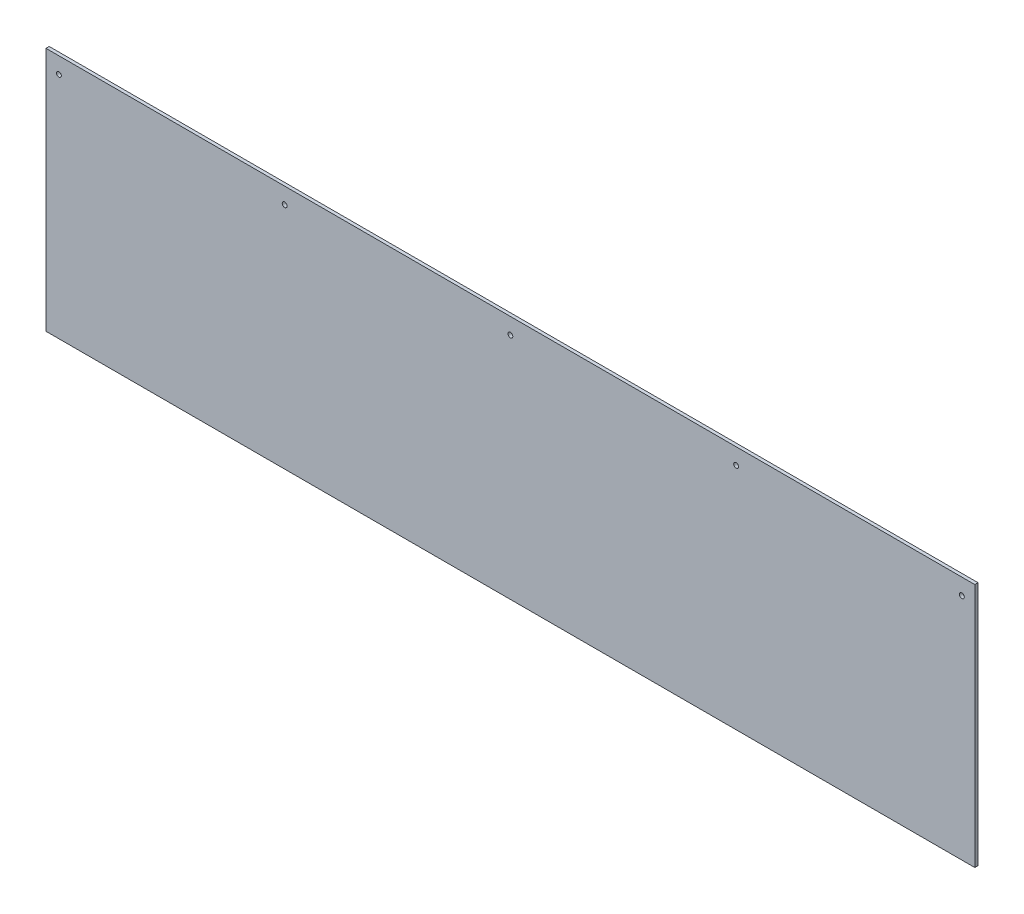
ISO-10303-21;
HEADER;
FILE_DESCRIPTION(('STEP AP214'),'2;1');
FILE_NAME('part.step','',(''),(''),'','','');
FILE_SCHEMA(('AUTOMOTIVE_DESIGN { 1 0 10303 214 1 1 1 1 }'));
ENDSEC;
DATA;
#1=APPLICATION_CONTEXT('core data for automotive mechanical design processes');
#2=APPLICATION_PROTOCOL_DEFINITION('international standard','automotive_design',2000,#1);
#3=PRODUCT_CONTEXT('',#1,'mechanical');
#4=PRODUCT('Part','Part','',(#3));
#5=PRODUCT_RELATED_PRODUCT_CATEGORY('part','',(#4));
#6=PRODUCT_DEFINITION_FORMATION('','',#4);
#7=PRODUCT_DEFINITION_CONTEXT('part definition',#1,'design');
#8=PRODUCT_DEFINITION('design','',#6,#7);
#9=PRODUCT_DEFINITION_SHAPE('','',#8);
#10=(LENGTH_UNIT() NAMED_UNIT(*) SI_UNIT(.MILLI.,.METRE.));
#11=(NAMED_UNIT(*) PLANE_ANGLE_UNIT() SI_UNIT($,.RADIAN.));
#12=(NAMED_UNIT(*) SI_UNIT($,.STERADIAN.) SOLID_ANGLE_UNIT());
#13=UNCERTAINTY_MEASURE_WITH_UNIT(LENGTH_MEASURE(1.E-05),#10,'distance_accuracy_value','');
#14=(GEOMETRIC_REPRESENTATION_CONTEXT(3) GLOBAL_UNCERTAINTY_ASSIGNED_CONTEXT((#13)) GLOBAL_UNIT_ASSIGNED_CONTEXT((#10,
#11,#12)) REPRESENTATION_CONTEXT('',''));
#15=CARTESIAN_POINT('',(0.,0.,0.));
#16=DIRECTION('',(0.,0.,1.));
#17=DIRECTION('',(1.,0.,0.));
#18=AXIS2_PLACEMENT_3D('',#15,#16,#17);
#19=CARTESIAN_POINT('',(0.,0.,6.35));
#20=DIRECTION('',(1.,0.,0.));
#21=DIRECTION('',(0.,0.,-1.));
#22=AXIS2_PLACEMENT_3D('',#19,#20,#21);
#23=PLANE('',#22);
#24=DIRECTION('',(0.,-1.,0.));
#25=VECTOR('',#24,1.);
#26=CARTESIAN_POINT('',(0.,0.,0.));
#27=LINE('',#26,#25);
#28=CARTESIAN_POINT('',(0.,482.6,0.));
#29=VERTEX_POINT('',#28);
#30=CARTESIAN_POINT('',(0.,0.,0.));
#31=VERTEX_POINT('',#30);
#32=EDGE_CURVE('E95',#29,#31,#27,.T.);
#33=ORIENTED_EDGE('',*,*,#32,.T.);
#34=DIRECTION('',(0.,0.,-1.));
#35=VECTOR('',#34,1.);
#36=CARTESIAN_POINT('',(0.,0.,6.35));
#37=LINE('',#36,#35);
#38=CARTESIAN_POINT('',(0.,0.,6.35));
#39=VERTEX_POINT('',#38);
#40=EDGE_CURVE('E11',#39,#31,#37,.T.);
#41=ORIENTED_EDGE('',*,*,#40,.F.);
#42=DIRECTION('',(0.,-1.,0.));
#43=VECTOR('',#42,1.);
#44=CARTESIAN_POINT('',(0.,0.,6.35));
#45=LINE('',#44,#43);
#46=CARTESIAN_POINT('',(0.,482.6,6.35));
#47=VERTEX_POINT('',#46);
#48=EDGE_CURVE('E83',#47,#39,#45,.T.);
#49=ORIENTED_EDGE('',*,*,#48,.F.);
#50=DIRECTION('',(0.,0.,-1.));
#51=VECTOR('',#50,1.);
#52=CARTESIAN_POINT('',(0.,482.6,6.35));
#53=LINE('',#52,#51);
#54=EDGE_CURVE('E91',#47,#29,#53,.T.);
#55=ORIENTED_EDGE('',*,*,#54,.T.);
#56=EDGE_LOOP('',(#33,#41,#49,#55));
#57=FACE_BOUND('',#56,.T.);
#58=ADVANCED_FACE('F32',(#57),#23,.F.);
#59=CARTESIAN_POINT('',(0.,0.,6.35));
#60=DIRECTION('',(0.,1.,0.));
#61=DIRECTION('',(0.,0.,1.));
#62=AXIS2_PLACEMENT_3D('',#59,#60,#61);
#63=PLANE('',#62);
#64=DIRECTION('',(1.,0.,0.));
#65=VECTOR('',#64,1.);
#66=CARTESIAN_POINT('',(0.,0.,0.));
#67=LINE('',#66,#65);
#68=CARTESIAN_POINT('',(1828.8,0.,0.));
#69=VERTEX_POINT('',#68);
#70=EDGE_CURVE('E87',#31,#69,#67,.T.);
#71=ORIENTED_EDGE('',*,*,#70,.T.);
#72=DIRECTION('',(0.,0.,-1.));
#73=VECTOR('',#72,1.);
#74=CARTESIAN_POINT('',(1828.8,0.,6.35));
#75=LINE('',#74,#73);
#76=CARTESIAN_POINT('',(1828.8,0.,6.35));
#77=VERTEX_POINT('',#76);
#78=EDGE_CURVE('E40',#77,#69,#75,.T.);
#79=ORIENTED_EDGE('',*,*,#78,.F.);
#80=DIRECTION('',(1.,0.,0.));
#81=VECTOR('',#80,1.);
#82=CARTESIAN_POINT('',(0.,0.,6.35));
#83=LINE('',#82,#81);
#84=EDGE_CURVE('E78',#39,#77,#83,.T.);
#85=ORIENTED_EDGE('',*,*,#84,.F.);
#86=ORIENTED_EDGE('',*,*,#40,.T.);
#87=EDGE_LOOP('',(#71,#79,#85,#86));
#88=FACE_BOUND('',#87,.T.);
#89=ADVANCED_FACE('F86',(#88),#63,.F.);
#90=CARTESIAN_POINT('',(1828.8,0.,6.35));
#91=DIRECTION('',(-1.,0.,0.));
#92=DIRECTION('',(0.,0.,1.));
#93=AXIS2_PLACEMENT_3D('',#90,#91,#92);
#94=PLANE('',#93);
#95=DIRECTION('',(0.,1.,0.));
#96=VECTOR('',#95,1.);
#97=CARTESIAN_POINT('',(1828.8,0.,0.));
#98=LINE('',#97,#96);
#99=CARTESIAN_POINT('',(1828.8,482.6,0.));
#100=VERTEX_POINT('',#99);
#101=EDGE_CURVE('E65',#69,#100,#98,.T.);
#102=ORIENTED_EDGE('',*,*,#101,.T.);
#103=DIRECTION('',(0.,0.,-1.));
#104=VECTOR('',#103,1.);
#105=CARTESIAN_POINT('',(1828.8,482.6,6.35));
#106=LINE('',#105,#104);
#107=CARTESIAN_POINT('',(1828.8,482.6,6.35));
#108=VERTEX_POINT('',#107);
#109=EDGE_CURVE('E88',#108,#100,#106,.T.);
#110=ORIENTED_EDGE('',*,*,#109,.F.);
#111=DIRECTION('',(0.,1.,0.));
#112=VECTOR('',#111,1.);
#113=CARTESIAN_POINT('',(1828.8,0.,6.35));
#114=LINE('',#113,#112);
#115=EDGE_CURVE('E81',#77,#108,#114,.T.);
#116=ORIENTED_EDGE('',*,*,#115,.F.);
#117=ORIENTED_EDGE('',*,*,#78,.T.);
#118=EDGE_LOOP('',(#102,#110,#116,#117));
#119=FACE_BOUND('',#118,.T.);
#120=ADVANCED_FACE('F89',(#119),#94,.F.);
#121=CARTESIAN_POINT('',(0.,482.6,6.35));
#122=DIRECTION('',(0.,-1.,0.));
#123=DIRECTION('',(1.,0.,0.));
#124=AXIS2_PLACEMENT_3D('',#121,#122,#123);
#125=PLANE('',#124);
#126=DIRECTION('',(-1.,0.,0.));
#127=VECTOR('',#126,1.);
#128=CARTESIAN_POINT('',(0.,482.6,0.));
#129=LINE('',#128,#127);
#130=EDGE_CURVE('E71',#100,#29,#129,.T.);
#131=ORIENTED_EDGE('',*,*,#130,.T.);
#132=ORIENTED_EDGE('',*,*,#54,.F.);
#133=DIRECTION('',(-1.,0.,0.));
#134=VECTOR('',#133,1.);
#135=CARTESIAN_POINT('',(0.,482.6,6.35));
#136=LINE('',#135,#134);
#137=EDGE_CURVE('E48',#108,#47,#136,.T.);
#138=ORIENTED_EDGE('',*,*,#137,.F.);
#139=ORIENTED_EDGE('',*,*,#109,.T.);
#140=EDGE_LOOP('',(#131,#132,#138,#139));
#141=FACE_BOUND('',#140,.T.);
#142=ADVANCED_FACE('F103',(#141),#125,.F.);
#143=CARTESIAN_POINT('',(0.,0.,6.35));
#144=DIRECTION('',(0.,0.,-1.));
#145=DIRECTION('',(-1.,0.,0.));
#146=AXIS2_PLACEMENT_3D('',#143,#144,#145);
#147=PLANE('',#146);
#148=CARTESIAN_POINT('',(25.4,450.85,6.35));
#149=DIRECTION('',(0.,0.,1.));
#150=DIRECTION('',(1.,0.,0.));
#151=AXIS2_PLACEMENT_3D('',#148,#149,#150);
#152=CIRCLE('',#151,4.7625);
#153=CARTESIAN_POINT('',(30.1625,450.85,6.35));
#154=VERTEX_POINT('',#153);
#155=EDGE_CURVE('E133',#154,#154,#152,.T.);
#156=ORIENTED_EDGE('',*,*,#155,.F.);
#157=EDGE_LOOP('',(#156));
#158=FACE_BOUND('',#157,.T.);
#159=CARTESIAN_POINT('',(469.9,450.85,6.35));
#160=DIRECTION('',(0.,0.,1.));
#161=DIRECTION('',(1.,0.,0.));
#162=AXIS2_PLACEMENT_3D('',#159,#160,#161);
#163=CIRCLE('',#162,4.76250000000001);
#164=CARTESIAN_POINT('',(474.6625,450.85,6.35));
#165=VERTEX_POINT('',#164);
#166=EDGE_CURVE('E127',#165,#165,#163,.T.);
#167=ORIENTED_EDGE('',*,*,#166,.F.);
#168=EDGE_LOOP('',(#167));
#169=FACE_BOUND('',#168,.T.);
#170=CARTESIAN_POINT('',(914.4,450.85,6.35));
#171=DIRECTION('',(0.,0.,1.));
#172=DIRECTION('',(1.,0.,0.));
#173=AXIS2_PLACEMENT_3D('',#170,#171,#172);
#174=CIRCLE('',#173,4.76250000000001);
#175=CARTESIAN_POINT('',(919.1625,450.85,6.35));
#176=VERTEX_POINT('',#175);
#177=EDGE_CURVE('E121',#176,#176,#174,.T.);
#178=ORIENTED_EDGE('',*,*,#177,.F.);
#179=EDGE_LOOP('',(#178));
#180=FACE_BOUND('',#179,.T.);
#181=CARTESIAN_POINT('',(1358.9,450.85,6.35));
#182=DIRECTION('',(0.,0.,1.));
#183=DIRECTION('',(1.,0.,0.));
#184=AXIS2_PLACEMENT_3D('',#181,#182,#183);
#185=CIRCLE('',#184,4.7624999999999);
#186=CARTESIAN_POINT('',(1363.6625,450.85,6.35));
#187=VERTEX_POINT('',#186);
#188=EDGE_CURVE('E115',#187,#187,#185,.T.);
#189=ORIENTED_EDGE('',*,*,#188,.F.);
#190=EDGE_LOOP('',(#189));
#191=FACE_BOUND('',#190,.T.);
#192=CARTESIAN_POINT('',(1803.4,450.85,6.35));
#193=DIRECTION('',(0.,0.,1.));
#194=DIRECTION('',(1.,0.,0.));
#195=AXIS2_PLACEMENT_3D('',#192,#193,#194);
#196=CIRCLE('',#195,4.7624999999999);
#197=CARTESIAN_POINT('',(1808.1625,450.85,6.35));
#198=VERTEX_POINT('',#197);
#199=EDGE_CURVE('E109',#198,#198,#196,.T.);
#200=ORIENTED_EDGE('',*,*,#199,.F.);
#201=EDGE_LOOP('',(#200));
#202=FACE_BOUND('',#201,.T.);
#203=ORIENTED_EDGE('',*,*,#48,.T.);
#204=ORIENTED_EDGE('',*,*,#84,.T.);
#205=ORIENTED_EDGE('',*,*,#115,.T.);
#206=ORIENTED_EDGE('',*,*,#137,.T.);
#207=EDGE_LOOP('',(#203,#204,#205,#206));
#208=FACE_BOUND('',#207,.T.);
#209=ADVANCED_FACE('F79',(#158,#169,#180,#191,#202,#208),#147,.F.);
#210=CARTESIAN_POINT('',(0.,0.,0.));
#211=DIRECTION('',(0.,0.,-1.));
#212=DIRECTION('',(-1.,0.,0.));
#213=AXIS2_PLACEMENT_3D('',#210,#211,#212);
#214=PLANE('',#213);
#215=CARTESIAN_POINT('',(25.4,450.85,0.));
#216=DIRECTION('',(0.,0.,1.));
#217=DIRECTION('',(1.,0.,0.));
#218=AXIS2_PLACEMENT_3D('',#215,#216,#217);
#219=CIRCLE('',#218,4.7625);
#220=CARTESIAN_POINT('',(30.1625,450.85,0.));
#221=VERTEX_POINT('',#220);
#222=EDGE_CURVE('E98',#221,#221,#219,.T.);
#223=ORIENTED_EDGE('',*,*,#222,.T.);
#224=EDGE_LOOP('',(#223));
#225=FACE_BOUND('',#224,.T.);
#226=CARTESIAN_POINT('',(469.9,450.85,0.));
#227=DIRECTION('',(0.,0.,1.));
#228=DIRECTION('',(1.,0.,0.));
#229=AXIS2_PLACEMENT_3D('',#226,#227,#228);
#230=CIRCLE('',#229,4.76250000000001);
#231=CARTESIAN_POINT('',(474.6625,450.85,0.));
#232=VERTEX_POINT('',#231);
#233=EDGE_CURVE('E130',#232,#232,#230,.T.);
#234=ORIENTED_EDGE('',*,*,#233,.T.);
#235=EDGE_LOOP('',(#234));
#236=FACE_BOUND('',#235,.T.);
#237=CARTESIAN_POINT('',(914.4,450.85,0.));
#238=DIRECTION('',(0.,0.,1.));
#239=DIRECTION('',(1.,0.,0.));
#240=AXIS2_PLACEMENT_3D('',#237,#238,#239);
#241=CIRCLE('',#240,4.76250000000001);
#242=CARTESIAN_POINT('',(919.1625,450.85,0.));
#243=VERTEX_POINT('',#242);
#244=EDGE_CURVE('E124',#243,#243,#241,.T.);
#245=ORIENTED_EDGE('',*,*,#244,.T.);
#246=EDGE_LOOP('',(#245));
#247=FACE_BOUND('',#246,.T.);
#248=CARTESIAN_POINT('',(1358.9,450.85,0.));
#249=DIRECTION('',(0.,0.,1.));
#250=DIRECTION('',(1.,0.,0.));
#251=AXIS2_PLACEMENT_3D('',#248,#249,#250);
#252=CIRCLE('',#251,4.7624999999999);
#253=CARTESIAN_POINT('',(1363.6625,450.85,0.));
#254=VERTEX_POINT('',#253);
#255=EDGE_CURVE('E118',#254,#254,#252,.T.);
#256=ORIENTED_EDGE('',*,*,#255,.T.);
#257=EDGE_LOOP('',(#256));
#258=FACE_BOUND('',#257,.T.);
#259=CARTESIAN_POINT('',(1803.4,450.85,0.));
#260=DIRECTION('',(0.,0.,1.));
#261=DIRECTION('',(1.,0.,0.));
#262=AXIS2_PLACEMENT_3D('',#259,#260,#261);
#263=CIRCLE('',#262,4.7624999999999);
#264=CARTESIAN_POINT('',(1808.1625,450.85,0.));
#265=VERTEX_POINT('',#264);
#266=EDGE_CURVE('E112',#265,#265,#263,.T.);
#267=ORIENTED_EDGE('',*,*,#266,.T.);
#268=EDGE_LOOP('',(#267));
#269=FACE_BOUND('',#268,.T.);
#270=ORIENTED_EDGE('',*,*,#32,.F.);
#271=ORIENTED_EDGE('',*,*,#130,.F.);
#272=ORIENTED_EDGE('',*,*,#101,.F.);
#273=ORIENTED_EDGE('',*,*,#70,.F.);
#274=EDGE_LOOP('',(#270,#271,#272,#273));
#275=FACE_BOUND('',#274,.T.);
#276=ADVANCED_FACE('F106',(#225,#236,#247,#258,#269,#275),#214,.T.);
#277=CARTESIAN_POINT('',(1803.4,450.85,0.));
#278=DIRECTION('',(0.,0.,1.));
#279=DIRECTION('',(1.,0.,0.));
#280=AXIS2_PLACEMENT_3D('',#277,#278,#279);
#281=CYLINDRICAL_SURFACE('',#280,4.7624999999999);
#282=ORIENTED_EDGE('',*,*,#266,.F.);
#283=EDGE_LOOP('',(#282));
#284=FACE_BOUND('',#283,.T.);
#285=ORIENTED_EDGE('',*,*,#199,.T.);
#286=EDGE_LOOP('',(#285));
#287=FACE_BOUND('',#286,.T.);
#288=ADVANCED_FACE('F159',(#284,#287),#281,.F.);
#289=CARTESIAN_POINT('',(1358.9,450.85,0.));
#290=DIRECTION('',(0.,0.,1.));
#291=DIRECTION('',(1.,0.,0.));
#292=AXIS2_PLACEMENT_3D('',#289,#290,#291);
#293=CYLINDRICAL_SURFACE('',#292,4.7624999999999);
#294=ORIENTED_EDGE('',*,*,#255,.F.);
#295=EDGE_LOOP('',(#294));
#296=FACE_BOUND('',#295,.T.);
#297=ORIENTED_EDGE('',*,*,#188,.T.);
#298=EDGE_LOOP('',(#297));
#299=FACE_BOUND('',#298,.T.);
#300=ADVANCED_FACE('F161',(#296,#299),#293,.F.);
#301=CARTESIAN_POINT('',(914.4,450.85,0.));
#302=DIRECTION('',(0.,0.,1.));
#303=DIRECTION('',(1.,0.,0.));
#304=AXIS2_PLACEMENT_3D('',#301,#302,#303);
#305=CYLINDRICAL_SURFACE('',#304,4.76250000000001);
#306=ORIENTED_EDGE('',*,*,#244,.F.);
#307=EDGE_LOOP('',(#306));
#308=FACE_BOUND('',#307,.T.);
#309=ORIENTED_EDGE('',*,*,#177,.T.);
#310=EDGE_LOOP('',(#309));
#311=FACE_BOUND('',#310,.T.);
#312=ADVANCED_FACE('F168',(#308,#311),#305,.F.);
#313=CARTESIAN_POINT('',(469.9,450.85,0.));
#314=DIRECTION('',(0.,0.,1.));
#315=DIRECTION('',(1.,0.,0.));
#316=AXIS2_PLACEMENT_3D('',#313,#314,#315);
#317=CYLINDRICAL_SURFACE('',#316,4.76250000000001);
#318=ORIENTED_EDGE('',*,*,#233,.F.);
#319=EDGE_LOOP('',(#318));
#320=FACE_BOUND('',#319,.T.);
#321=ORIENTED_EDGE('',*,*,#166,.T.);
#322=EDGE_LOOP('',(#321));
#323=FACE_BOUND('',#322,.T.);
#324=ADVANCED_FACE('F144',(#320,#323),#317,.F.);
#325=CARTESIAN_POINT('',(25.4,450.85,0.));
#326=DIRECTION('',(0.,0.,1.));
#327=DIRECTION('',(1.,0.,0.));
#328=AXIS2_PLACEMENT_3D('',#325,#326,#327);
#329=CYLINDRICAL_SURFACE('',#328,4.7625);
#330=ORIENTED_EDGE('',*,*,#222,.F.);
#331=EDGE_LOOP('',(#330));
#332=FACE_BOUND('',#331,.T.);
#333=ORIENTED_EDGE('',*,*,#155,.T.);
#334=EDGE_LOOP('',(#333));
#335=FACE_BOUND('',#334,.T.);
#336=ADVANCED_FACE('F141',(#332,#335),#329,.F.);
#337=CLOSED_SHELL('',(#58,#89,#120,#142,#209,#276,#288,#300,#312,#324,#336));
#338=MANIFOLD_SOLID_BREP('B2',#337);
#339=ADVANCED_BREP_SHAPE_REPRESENTATION('',(#18,#338),#14);
#340=SHAPE_DEFINITION_REPRESENTATION(#9,#339);
ENDSEC;
END-ISO-10303-21;
